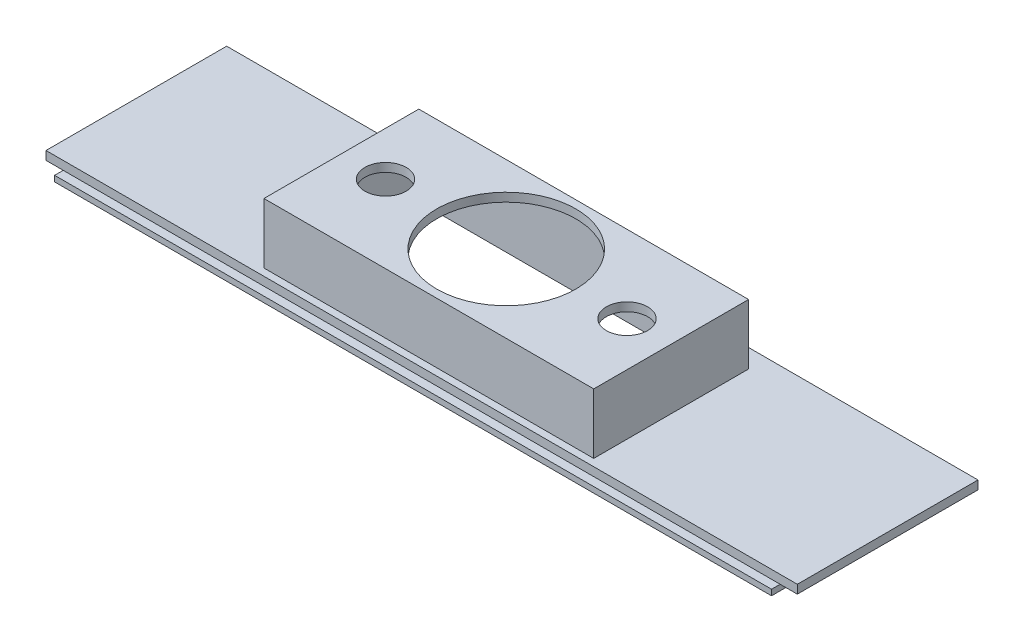
ISO-10303-21;
HEADER;
FILE_DESCRIPTION(('STEP AP214'),'2;1');
FILE_NAME('part.step','',(''),(''),'','','');
FILE_SCHEMA(('AUTOMOTIVE_DESIGN { 1 0 10303 214 1 1 1 1 }'));
ENDSEC;
DATA;
#1=APPLICATION_CONTEXT('core data for automotive mechanical design processes');
#2=APPLICATION_PROTOCOL_DEFINITION('international standard','automotive_design',2000,#1);
#3=PRODUCT_CONTEXT('',#1,'mechanical');
#4=PRODUCT('Part','Part','',(#3));
#5=PRODUCT_RELATED_PRODUCT_CATEGORY('part','',(#4));
#6=PRODUCT_DEFINITION_FORMATION('','',#4);
#7=PRODUCT_DEFINITION_CONTEXT('part definition',#1,'design');
#8=PRODUCT_DEFINITION('design','',#6,#7);
#9=PRODUCT_DEFINITION_SHAPE('','',#8);
#10=(LENGTH_UNIT() NAMED_UNIT(*) SI_UNIT(.MILLI.,.METRE.));
#11=(NAMED_UNIT(*) PLANE_ANGLE_UNIT() SI_UNIT($,.RADIAN.));
#12=(NAMED_UNIT(*) SI_UNIT($,.STERADIAN.) SOLID_ANGLE_UNIT());
#13=UNCERTAINTY_MEASURE_WITH_UNIT(LENGTH_MEASURE(1.E-05),#10,'distance_accuracy_value','');
#14=(GEOMETRIC_REPRESENTATION_CONTEXT(3) GLOBAL_UNCERTAINTY_ASSIGNED_CONTEXT((#13)) GLOBAL_UNIT_ASSIGNED_CONTEXT((#10,
#11,#12)) REPRESENTATION_CONTEXT('',''));
#15=CARTESIAN_POINT('',(0.,0.,0.));
#16=DIRECTION('',(0.,0.,1.));
#17=DIRECTION('',(1.,0.,0.));
#18=AXIS2_PLACEMENT_3D('',#15,#16,#17);
#19=CARTESIAN_POINT('',(0.,0.,0.));
#20=DIRECTION('',(0.,1.,0.));
#21=DIRECTION('',(0.,0.,1.));
#22=AXIS2_PLACEMENT_3D('',#19,#20,#21);
#23=PLANE('',#22);
#24=DIRECTION('',(0.,0.,-1.));
#25=VECTOR('',#24,1.);
#26=CARTESIAN_POINT('',(-125.,0.,31.5));
#27=LINE('',#26,#25);
#28=CARTESIAN_POINT('',(-125.,0.,29.5));
#29=VERTEX_POINT('',#28);
#30=CARTESIAN_POINT('',(-125.,0.,-27.5));
#31=VERTEX_POINT('',#30);
#32=EDGE_CURVE('E11',#29,#31,#27,.T.);
#33=ORIENTED_EDGE('',*,*,#32,.F.);
#34=DIRECTION('',(1.,0.,0.));
#35=VECTOR('',#34,1.);
#36=CARTESIAN_POINT('',(-127.,0.,29.5));
#37=LINE('',#36,#35);
#38=CARTESIAN_POINT('',(-131.,0.,29.5));
#39=VERTEX_POINT('',#38);
#40=EDGE_CURVE('E38',#39,#29,#37,.T.);
#41=ORIENTED_EDGE('',*,*,#40,.F.);
#42=DIRECTION('',(0.,0.,1.));
#43=VECTOR('',#42,1.);
#44=CARTESIAN_POINT('',(-131.,0.,-29.5));
#45=LINE('',#44,#43);
#46=CARTESIAN_POINT('',(-131.,0.,-33.5));
#47=VERTEX_POINT('',#46);
#48=EDGE_CURVE('E206',#47,#39,#45,.T.);
#49=ORIENTED_EDGE('',*,*,#48,.F.);
#50=DIRECTION('',(-1.,0.,0.));
#51=VECTOR('',#50,1.);
#52=CARTESIAN_POINT('',(127.,0.,-33.5));
#53=LINE('',#52,#51);
#54=CARTESIAN_POINT('',(131.,0.,-33.5));
#55=VERTEX_POINT('',#54);
#56=EDGE_CURVE('E198',#55,#47,#53,.T.);
#57=ORIENTED_EDGE('',*,*,#56,.F.);
#58=DIRECTION('',(0.,0.,-1.));
#59=VECTOR('',#58,1.);
#60=CARTESIAN_POINT('',(131.,0.,29.5));
#61=LINE('',#60,#59);
#62=CARTESIAN_POINT('',(131.,0.,29.5));
#63=VERTEX_POINT('',#62);
#64=EDGE_CURVE('E189',#63,#55,#61,.T.);
#65=ORIENTED_EDGE('',*,*,#64,.F.);
#66=CARTESIAN_POINT('',(125.,0.,29.5));
#67=VERTEX_POINT('',#66);
#68=EDGE_CURVE('E57',#67,#63,#37,.T.);
#69=ORIENTED_EDGE('',*,*,#68,.F.);
#70=DIRECTION('',(0.,0.,1.));
#71=VECTOR('',#70,1.);
#72=CARTESIAN_POINT('',(125.,0.,-27.5));
#73=LINE('',#72,#71);
#74=CARTESIAN_POINT('',(125.,0.,-27.5));
#75=VERTEX_POINT('',#74);
#76=EDGE_CURVE('E165',#75,#67,#73,.T.);
#77=ORIENTED_EDGE('',*,*,#76,.F.);
#78=DIRECTION('',(1.,0.,0.));
#79=VECTOR('',#78,1.);
#80=CARTESIAN_POINT('',(-125.,0.,-27.5));
#81=LINE('',#80,#79);
#82=EDGE_CURVE('E52',#31,#75,#81,.T.);
#83=ORIENTED_EDGE('',*,*,#82,.F.);
#84=EDGE_LOOP('',(#33,#41,#49,#57,#65,#69,#77,#83));
#85=FACE_BOUND('',#84,.T.);
#86=ADVANCED_FACE('F34',(#85),#23,.F.);
#87=CARTESIAN_POINT('',(0.,3.,0.));
#88=DIRECTION('',(0.,1.,0.));
#89=DIRECTION('',(0.,0.,1.));
#90=AXIS2_PLACEMENT_3D('',#87,#88,#89);
#91=PLANE('',#90);
#92=DIRECTION('',(1.,0.,0.));
#93=VECTOR('',#92,1.);
#94=CARTESIAN_POINT('',(-127.,3.,29.5));
#95=LINE('',#94,#93);
#96=CARTESIAN_POINT('',(-131.,3.,29.5));
#97=VERTEX_POINT('',#96);
#98=CARTESIAN_POINT('',(131.,3.,29.5));
#99=VERTEX_POINT('',#98);
#100=EDGE_CURVE('E43',#97,#99,#95,.T.);
#101=ORIENTED_EDGE('',*,*,#100,.T.);
#102=DIRECTION('',(0.,0.,1.));
#103=VECTOR('',#102,1.);
#104=CARTESIAN_POINT('',(131.,3.,29.5));
#105=LINE('',#104,#103);
#106=CARTESIAN_POINT('',(131.,3.,-33.5));
#107=VERTEX_POINT('',#106);
#108=EDGE_CURVE('E195',#107,#99,#105,.T.);
#109=ORIENTED_EDGE('',*,*,#108,.F.);
#110=DIRECTION('',(1.,0.,0.));
#111=VECTOR('',#110,1.);
#112=CARTESIAN_POINT('',(127.,3.,-33.5));
#113=LINE('',#112,#111);
#114=CARTESIAN_POINT('',(-131.,3.,-33.5));
#115=VERTEX_POINT('',#114);
#116=EDGE_CURVE('E204',#115,#107,#113,.T.);
#117=ORIENTED_EDGE('',*,*,#116,.F.);
#118=DIRECTION('',(0.,0.,-1.));
#119=VECTOR('',#118,1.);
#120=CARTESIAN_POINT('',(-131.,3.,-29.5));
#121=LINE('',#120,#119);
#122=EDGE_CURVE('E212',#97,#115,#121,.T.);
#123=ORIENTED_EDGE('',*,*,#122,.F.);
#124=EDGE_LOOP('',(#101,#109,#117,#123));
#125=FACE_BOUND('',#124,.T.);
#126=DIRECTION('',(-1.,0.,0.));
#127=VECTOR('',#126,1.);
#128=CARTESIAN_POINT('',(-57.5,3.,-27.));
#129=LINE('',#128,#127);
#130=CARTESIAN_POINT('',(57.5,3.,-27.));
#131=VERTEX_POINT('',#130);
#132=CARTESIAN_POINT('',(-57.5,3.,-27.));
#133=VERTEX_POINT('',#132);
#134=EDGE_CURVE('E286',#131,#133,#129,.T.);
#135=ORIENTED_EDGE('',*,*,#134,.F.);
#136=DIRECTION('',(0.,0.,-1.));
#137=VECTOR('',#136,1.);
#138=CARTESIAN_POINT('',(57.5,3.,-27.));
#139=LINE('',#138,#137);
#140=CARTESIAN_POINT('',(57.5,3.,27.));
#141=VERTEX_POINT('',#140);
#142=EDGE_CURVE('E267',#141,#131,#139,.T.);
#143=ORIENTED_EDGE('',*,*,#142,.F.);
#144=DIRECTION('',(1.,0.,0.));
#145=VECTOR('',#144,1.);
#146=CARTESIAN_POINT('',(-57.5,3.,27.));
#147=LINE('',#146,#145);
#148=CARTESIAN_POINT('',(-57.5,3.,27.));
#149=VERTEX_POINT('',#148);
#150=EDGE_CURVE('E277',#149,#141,#147,.T.);
#151=ORIENTED_EDGE('',*,*,#150,.F.);
#152=DIRECTION('',(0.,0.,1.));
#153=VECTOR('',#152,1.);
#154=CARTESIAN_POINT('',(-57.5,3.,-27.));
#155=LINE('',#154,#153);
#156=EDGE_CURVE('E288',#133,#149,#155,.T.);
#157=ORIENTED_EDGE('',*,*,#156,.F.);
#158=EDGE_LOOP('',(#135,#143,#151,#157));
#159=FACE_BOUND('',#158,.T.);
#160=ADVANCED_FACE('F314',(#125,#159),#91,.T.);
#161=CARTESIAN_POINT('',(-127.,3.,29.5));
#162=DIRECTION('',(0.,0.,-1.));
#163=DIRECTION('',(-1.,0.,0.));
#164=AXIS2_PLACEMENT_3D('',#161,#162,#163);
#165=PLANE('',#164);
#166=ORIENTED_EDGE('',*,*,#40,.T.);
#167=EDGE_CURVE('E304',#29,#67,#37,.T.);
#168=ORIENTED_EDGE('',*,*,#167,.T.);
#169=ORIENTED_EDGE('',*,*,#68,.T.);
#170=DIRECTION('',(0.,-1.,0.));
#171=VECTOR('',#170,1.);
#172=CARTESIAN_POINT('',(131.,3.,29.5));
#173=LINE('',#172,#171);
#174=EDGE_CURVE('E186',#99,#63,#173,.T.);
#175=ORIENTED_EDGE('',*,*,#174,.F.);
#176=ORIENTED_EDGE('',*,*,#100,.F.);
#177=DIRECTION('',(0.,1.,0.));
#178=VECTOR('',#177,1.);
#179=CARTESIAN_POINT('',(-131.,3.,29.5));
#180=LINE('',#179,#178);
#181=EDGE_CURVE('E209',#39,#97,#180,.T.);
#182=ORIENTED_EDGE('',*,*,#181,.F.);
#183=EDGE_LOOP('',(#166,#168,#169,#175,#176,#182));
#184=FACE_BOUND('',#183,.T.);
#185=ADVANCED_FACE('F36',(#184),#165,.F.);
#186=CARTESIAN_POINT('',(57.5,24.,-27.));
#187=DIRECTION('',(-1.,0.,0.));
#188=DIRECTION('',(0.,0.,1.));
#189=AXIS2_PLACEMENT_3D('',#186,#187,#188);
#190=PLANE('',#189);
#191=ORIENTED_EDGE('',*,*,#142,.T.);
#192=DIRECTION('',(0.,-1.,0.));
#193=VECTOR('',#192,1.);
#194=CARTESIAN_POINT('',(57.5,24.,-27.));
#195=LINE('',#194,#193);
#196=CARTESIAN_POINT('',(57.5,24.,-27.));
#197=VERTEX_POINT('',#196);
#198=EDGE_CURVE('E299',#197,#131,#195,.T.);
#199=ORIENTED_EDGE('',*,*,#198,.F.);
#200=DIRECTION('',(0.,0.,-1.));
#201=VECTOR('',#200,1.);
#202=CARTESIAN_POINT('',(57.5,24.,-27.));
#203=LINE('',#202,#201);
#204=CARTESIAN_POINT('',(57.5,24.,27.));
#205=VERTEX_POINT('',#204);
#206=EDGE_CURVE('E273',#205,#197,#203,.T.);
#207=ORIENTED_EDGE('',*,*,#206,.F.);
#208=DIRECTION('',(0.,-1.,0.));
#209=VECTOR('',#208,1.);
#210=CARTESIAN_POINT('',(57.5,24.,27.));
#211=LINE('',#210,#209);
#212=EDGE_CURVE('E283',#205,#141,#211,.T.);
#213=ORIENTED_EDGE('',*,*,#212,.T.);
#214=EDGE_LOOP('',(#191,#199,#207,#213));
#215=FACE_BOUND('',#214,.T.);
#216=ADVANCED_FACE('F344',(#215),#190,.F.);
#217=CARTESIAN_POINT('',(-57.5,24.,-27.));
#218=DIRECTION('',(0.,0.,1.));
#219=DIRECTION('',(1.,0.,0.));
#220=AXIS2_PLACEMENT_3D('',#217,#218,#219);
#221=PLANE('',#220);
#222=ORIENTED_EDGE('',*,*,#134,.T.);
#223=DIRECTION('',(0.,-1.,0.));
#224=VECTOR('',#223,1.);
#225=CARTESIAN_POINT('',(-57.5,24.,-27.));
#226=LINE('',#225,#224);
#227=CARTESIAN_POINT('',(-57.5,24.,-27.));
#228=VERTEX_POINT('',#227);
#229=EDGE_CURVE('E296',#228,#133,#226,.T.);
#230=ORIENTED_EDGE('',*,*,#229,.F.);
#231=DIRECTION('',(-1.,0.,0.));
#232=VECTOR('',#231,1.);
#233=CARTESIAN_POINT('',(-57.5,24.,-27.));
#234=LINE('',#233,#232);
#235=EDGE_CURVE('E276',#197,#228,#234,.T.);
#236=ORIENTED_EDGE('',*,*,#235,.F.);
#237=ORIENTED_EDGE('',*,*,#198,.T.);
#238=EDGE_LOOP('',(#222,#230,#236,#237));
#239=FACE_BOUND('',#238,.T.);
#240=ADVANCED_FACE('F347',(#239),#221,.F.);
#241=CARTESIAN_POINT('',(-57.5,24.,-27.));
#242=DIRECTION('',(1.,0.,0.));
#243=DIRECTION('',(0.,0.,-1.));
#244=AXIS2_PLACEMENT_3D('',#241,#242,#243);
#245=PLANE('',#244);
#246=ORIENTED_EDGE('',*,*,#156,.T.);
#247=DIRECTION('',(0.,-1.,0.));
#248=VECTOR('',#247,1.);
#249=CARTESIAN_POINT('',(-57.5,24.,27.));
#250=LINE('',#249,#248);
#251=CARTESIAN_POINT('',(-57.5,24.,27.));
#252=VERTEX_POINT('',#251);
#253=EDGE_CURVE('E294',#252,#149,#250,.T.);
#254=ORIENTED_EDGE('',*,*,#253,.F.);
#255=DIRECTION('',(0.,0.,1.));
#256=VECTOR('',#255,1.);
#257=CARTESIAN_POINT('',(-57.5,24.,-27.));
#258=LINE('',#257,#256);
#259=EDGE_CURVE('E279',#228,#252,#258,.T.);
#260=ORIENTED_EDGE('',*,*,#259,.F.);
#261=ORIENTED_EDGE('',*,*,#229,.T.);
#262=EDGE_LOOP('',(#246,#254,#260,#261));
#263=FACE_BOUND('',#262,.T.);
#264=ADVANCED_FACE('F351',(#263),#245,.F.);
#265=CARTESIAN_POINT('',(-57.5,24.,27.));
#266=DIRECTION('',(0.,0.,-1.));
#267=DIRECTION('',(-1.,0.,0.));
#268=AXIS2_PLACEMENT_3D('',#265,#266,#267);
#269=PLANE('',#268);
#270=ORIENTED_EDGE('',*,*,#150,.T.);
#271=ORIENTED_EDGE('',*,*,#212,.F.);
#272=DIRECTION('',(1.,0.,0.));
#273=VECTOR('',#272,1.);
#274=CARTESIAN_POINT('',(-57.5,24.,27.));
#275=LINE('',#274,#273);
#276=EDGE_CURVE('E281',#252,#205,#275,.T.);
#277=ORIENTED_EDGE('',*,*,#276,.F.);
#278=ORIENTED_EDGE('',*,*,#253,.T.);
#279=EDGE_LOOP('',(#270,#271,#277,#278));
#280=FACE_BOUND('',#279,.T.);
#281=ADVANCED_FACE('F355',(#280),#269,.F.);
#282=CARTESIAN_POINT('',(0.,24.,0.));
#283=DIRECTION('',(0.,1.,0.));
#284=DIRECTION('',(0.,0.,1.));
#285=AXIS2_PLACEMENT_3D('',#282,#283,#284);
#286=PLANE('',#285);
#287=CARTESIAN_POINT('',(0.,24.,0.));
#288=DIRECTION('',(0.,1.,0.));
#289=DIRECTION('',(0.,0.,1.));
#290=AXIS2_PLACEMENT_3D('',#287,#288,#289);
#291=CIRCLE('',#290,24.25);
#292=CARTESIAN_POINT('',(0.,24.,24.25));
#293=VERTEX_POINT('',#292);
#294=EDGE_CURVE('E241',#293,#293,#291,.T.);
#295=ORIENTED_EDGE('',*,*,#294,.F.);
#296=EDGE_LOOP('',(#295));
#297=FACE_BOUND('',#296,.T.);
#298=CARTESIAN_POINT('',(42.1,24.,0.));
#299=DIRECTION('',(0.,1.,0.));
#300=DIRECTION('',(0.,0.,1.));
#301=AXIS2_PLACEMENT_3D('',#298,#299,#300);
#302=CIRCLE('',#301,7.2);
#303=CARTESIAN_POINT('',(42.1,24.,7.19999999999999));
#304=VERTEX_POINT('',#303);
#305=EDGE_CURVE('E236',#304,#304,#302,.T.);
#306=ORIENTED_EDGE('',*,*,#305,.F.);
#307=EDGE_LOOP('',(#306));
#308=FACE_BOUND('',#307,.T.);
#309=CARTESIAN_POINT('',(-42.1,24.,0.));
#310=DIRECTION('',(0.,1.,0.));
#311=DIRECTION('',(0.,0.,1.));
#312=AXIS2_PLACEMENT_3D('',#309,#310,#311);
#313=CIRCLE('',#312,7.2);
#314=CARTESIAN_POINT('',(-42.1,24.,7.19999999999999));
#315=VERTEX_POINT('',#314);
#316=EDGE_CURVE('E240',#315,#315,#313,.T.);
#317=ORIENTED_EDGE('',*,*,#316,.F.);
#318=EDGE_LOOP('',(#317));
#319=FACE_BOUND('',#318,.T.);
#320=ORIENTED_EDGE('',*,*,#206,.T.);
#321=ORIENTED_EDGE('',*,*,#235,.T.);
#322=ORIENTED_EDGE('',*,*,#259,.T.);
#323=ORIENTED_EDGE('',*,*,#276,.T.);
#324=EDGE_LOOP('',(#320,#321,#322,#323));
#325=FACE_BOUND('',#324,.T.);
#326=ADVANCED_FACE('F359',(#297,#308,#319,#325),#286,.T.);
#327=CARTESIAN_POINT('',(-55.5,21.,0.));
#328=DIRECTION('',(1.,0.,0.));
#329=DIRECTION('',(0.,0.,-1.));
#330=AXIS2_PLACEMENT_3D('',#327,#328,#329);
#331=PLANE('',#330);
#332=DIRECTION('',(0.,-1.,0.));
#333=VECTOR('',#332,1.);
#334=CARTESIAN_POINT('',(-55.5,21.,25.));
#335=LINE('',#334,#333);
#336=CARTESIAN_POINT('',(-55.5,21.,25.));
#337=VERTEX_POINT('',#336);
#338=CARTESIAN_POINT('',(-55.5,-2.,25.));
#339=VERTEX_POINT('',#338);
#340=EDGE_CURVE('E265',#337,#339,#335,.T.);
#341=ORIENTED_EDGE('',*,*,#340,.T.);
#342=DIRECTION('',(0.,0.,-1.));
#343=VECTOR('',#342,1.);
#344=CARTESIAN_POINT('',(-55.5,-2.,-25.));
#345=LINE('',#344,#343);
#346=CARTESIAN_POINT('',(-55.5,-2.,-25.));
#347=VERTEX_POINT('',#346);
#348=EDGE_CURVE('E223',#339,#347,#345,.T.);
#349=ORIENTED_EDGE('',*,*,#348,.T.);
#350=DIRECTION('',(0.,-1.,0.));
#351=VECTOR('',#350,1.);
#352=CARTESIAN_POINT('',(-55.5,21.,-25.));
#353=LINE('',#352,#351);
#354=CARTESIAN_POINT('',(-55.5,21.,-25.));
#355=VERTEX_POINT('',#354);
#356=EDGE_CURVE('E264',#355,#347,#353,.T.);
#357=ORIENTED_EDGE('',*,*,#356,.F.);
#358=DIRECTION('',(0.,0.,1.));
#359=VECTOR('',#358,1.);
#360=CARTESIAN_POINT('',(-55.5,21.,0.));
#361=LINE('',#360,#359);
#362=EDGE_CURVE('E252',#355,#337,#361,.T.);
#363=ORIENTED_EDGE('',*,*,#362,.T.);
#364=EDGE_LOOP('',(#341,#349,#357,#363));
#365=FACE_BOUND('',#364,.T.);
#366=ADVANCED_FACE('F363',(#365),#331,.T.);
#367=CARTESIAN_POINT('',(0.,21.,25.));
#368=DIRECTION('',(0.,0.,-1.));
#369=DIRECTION('',(-1.,0.,0.));
#370=AXIS2_PLACEMENT_3D('',#367,#368,#369);
#371=PLANE('',#370);
#372=DIRECTION('',(0.,-1.,0.));
#373=VECTOR('',#372,1.);
#374=CARTESIAN_POINT('',(55.5,21.,25.));
#375=LINE('',#374,#373);
#376=CARTESIAN_POINT('',(55.5,21.,25.));
#377=VERTEX_POINT('',#376);
#378=CARTESIAN_POINT('',(55.5,-2.,25.));
#379=VERTEX_POINT('',#378);
#380=EDGE_CURVE('E268',#377,#379,#375,.T.);
#381=ORIENTED_EDGE('',*,*,#380,.T.);
#382=DIRECTION('',(-1.,0.,0.));
#383=VECTOR('',#382,1.);
#384=CARTESIAN_POINT('',(-55.5,-2.,25.));
#385=LINE('',#384,#383);
#386=EDGE_CURVE('E220',#379,#339,#385,.T.);
#387=ORIENTED_EDGE('',*,*,#386,.T.);
#388=ORIENTED_EDGE('',*,*,#340,.F.);
#389=DIRECTION('',(1.,0.,0.));
#390=VECTOR('',#389,1.);
#391=CARTESIAN_POINT('',(0.,21.,25.));
#392=LINE('',#391,#390);
#393=EDGE_CURVE('E262',#337,#377,#392,.T.);
#394=ORIENTED_EDGE('',*,*,#393,.T.);
#395=EDGE_LOOP('',(#381,#387,#388,#394));
#396=FACE_BOUND('',#395,.T.);
#397=ADVANCED_FACE('F367',(#396),#371,.T.);
#398=CARTESIAN_POINT('',(55.5,21.,0.));
#399=DIRECTION('',(-1.,0.,0.));
#400=DIRECTION('',(0.,0.,1.));
#401=AXIS2_PLACEMENT_3D('',#398,#399,#400);
#402=PLANE('',#401);
#403=DIRECTION('',(0.,-1.,0.));
#404=VECTOR('',#403,1.);
#405=CARTESIAN_POINT('',(55.5,21.,-25.));
#406=LINE('',#405,#404);
#407=CARTESIAN_POINT('',(55.5,21.,-25.));
#408=VERTEX_POINT('',#407);
#409=CARTESIAN_POINT('',(55.5,-2.,-25.));
#410=VERTEX_POINT('',#409);
#411=EDGE_CURVE('E270',#408,#410,#406,.T.);
#412=ORIENTED_EDGE('',*,*,#411,.T.);
#413=DIRECTION('',(0.,0.,1.));
#414=VECTOR('',#413,1.);
#415=CARTESIAN_POINT('',(55.5,-2.,25.));
#416=LINE('',#415,#414);
#417=EDGE_CURVE('E217',#410,#379,#416,.T.);
#418=ORIENTED_EDGE('',*,*,#417,.T.);
#419=ORIENTED_EDGE('',*,*,#380,.F.);
#420=DIRECTION('',(0.,0.,-1.));
#421=VECTOR('',#420,1.);
#422=CARTESIAN_POINT('',(55.5,21.,0.));
#423=LINE('',#422,#421);
#424=EDGE_CURVE('E260',#377,#408,#423,.T.);
#425=ORIENTED_EDGE('',*,*,#424,.T.);
#426=EDGE_LOOP('',(#412,#418,#419,#425));
#427=FACE_BOUND('',#426,.T.);
#428=ADVANCED_FACE('F373',(#427),#402,.T.);
#429=CARTESIAN_POINT('',(0.,21.,-25.));
#430=DIRECTION('',(0.,0.,-1.));
#431=DIRECTION('',(-1.,0.,0.));
#432=AXIS2_PLACEMENT_3D('',#429,#430,#431);
#433=PLANE('',#432);
#434=ORIENTED_EDGE('',*,*,#356,.T.);
#435=DIRECTION('',(1.,0.,0.));
#436=VECTOR('',#435,1.);
#437=CARTESIAN_POINT('',(-55.5,-2.,-25.));
#438=LINE('',#437,#436);
#439=EDGE_CURVE('E214',#347,#410,#438,.T.);
#440=ORIENTED_EDGE('',*,*,#439,.T.);
#441=ORIENTED_EDGE('',*,*,#411,.F.);
#442=DIRECTION('',(1.,0.,0.));
#443=VECTOR('',#442,1.);
#444=CARTESIAN_POINT('',(0.,21.,-25.));
#445=LINE('',#444,#443);
#446=EDGE_CURVE('E257',#355,#408,#445,.T.);
#447=ORIENTED_EDGE('',*,*,#446,.F.);
#448=EDGE_LOOP('',(#434,#440,#441,#447));
#449=FACE_BOUND('',#448,.T.);
#450=ADVANCED_FACE('F369',(#449),#433,.F.);
#451=CARTESIAN_POINT('',(0.,21.,0.));
#452=DIRECTION('',(0.,-1.,0.));
#453=DIRECTION('',(0.,0.,-1.));
#454=AXIS2_PLACEMENT_3D('',#451,#452,#453);
#455=PLANE('',#454);
#456=CARTESIAN_POINT('',(0.,21.,0.));
#457=DIRECTION('',(0.,1.,0.));
#458=DIRECTION('',(0.,0.,1.));
#459=AXIS2_PLACEMENT_3D('',#456,#457,#458);
#460=CIRCLE('',#459,24.25);
#461=CARTESIAN_POINT('',(0.,21.,24.25));
#462=VERTEX_POINT('',#461);
#463=EDGE_CURVE('E237',#462,#462,#460,.T.);
#464=ORIENTED_EDGE('',*,*,#463,.T.);
#465=EDGE_LOOP('',(#464));
#466=FACE_BOUND('',#465,.T.);
#467=CARTESIAN_POINT('',(42.1,21.,0.));
#468=DIRECTION('',(0.,1.,0.));
#469=DIRECTION('',(0.,0.,1.));
#470=AXIS2_PLACEMENT_3D('',#467,#468,#469);
#471=CIRCLE('',#470,7.2);
#472=CARTESIAN_POINT('',(42.1,21.,7.19999999999999));
#473=VERTEX_POINT('',#472);
#474=EDGE_CURVE('E244',#473,#473,#471,.T.);
#475=ORIENTED_EDGE('',*,*,#474,.T.);
#476=EDGE_LOOP('',(#475));
#477=FACE_BOUND('',#476,.T.);
#478=CARTESIAN_POINT('',(-42.1,21.,0.));
#479=DIRECTION('',(0.,1.,0.));
#480=DIRECTION('',(0.,0.,1.));
#481=AXIS2_PLACEMENT_3D('',#478,#479,#480);
#482=CIRCLE('',#481,7.2);
#483=CARTESIAN_POINT('',(-42.1,21.,7.19999999999999));
#484=VERTEX_POINT('',#483);
#485=EDGE_CURVE('E249',#484,#484,#482,.T.);
#486=ORIENTED_EDGE('',*,*,#485,.T.);
#487=EDGE_LOOP('',(#486));
#488=FACE_BOUND('',#487,.T.);
#489=ORIENTED_EDGE('',*,*,#362,.F.);
#490=ORIENTED_EDGE('',*,*,#446,.T.);
#491=ORIENTED_EDGE('',*,*,#424,.F.);
#492=ORIENTED_EDGE('',*,*,#393,.F.);
#493=EDGE_LOOP('',(#489,#490,#491,#492));
#494=FACE_BOUND('',#493,.T.);
#495=ADVANCED_FACE('F372',(#466,#477,#488,#494),#455,.T.);
#496=CARTESIAN_POINT('',(-42.1,21.,0.));
#497=DIRECTION('',(0.,1.,0.));
#498=DIRECTION('',(0.,0.,1.));
#499=AXIS2_PLACEMENT_3D('',#496,#497,#498);
#500=CYLINDRICAL_SURFACE('',#499,7.2);
#501=ORIENTED_EDGE('',*,*,#485,.F.);
#502=EDGE_LOOP('',(#501));
#503=FACE_BOUND('',#502,.T.);
#504=ORIENTED_EDGE('',*,*,#316,.T.);
#505=EDGE_LOOP('',(#504));
#506=FACE_BOUND('',#505,.T.);
#507=ADVANCED_FACE('F383',(#503,#506),#500,.F.);
#508=CARTESIAN_POINT('',(42.1,21.,0.));
#509=DIRECTION('',(0.,1.,0.));
#510=DIRECTION('',(0.,0.,1.));
#511=AXIS2_PLACEMENT_3D('',#508,#509,#510);
#512=CYLINDRICAL_SURFACE('',#511,7.2);
#513=ORIENTED_EDGE('',*,*,#474,.F.);
#514=EDGE_LOOP('',(#513));
#515=FACE_BOUND('',#514,.T.);
#516=ORIENTED_EDGE('',*,*,#305,.T.);
#517=EDGE_LOOP('',(#516));
#518=FACE_BOUND('',#517,.T.);
#519=ADVANCED_FACE('F387',(#515,#518),#512,.F.);
#520=CARTESIAN_POINT('',(0.,21.,0.));
#521=DIRECTION('',(0.,1.,0.));
#522=DIRECTION('',(0.,0.,1.));
#523=AXIS2_PLACEMENT_3D('',#520,#521,#522);
#524=CYLINDRICAL_SURFACE('',#523,24.25);
#525=ORIENTED_EDGE('',*,*,#463,.F.);
#526=EDGE_LOOP('',(#525));
#527=FACE_BOUND('',#526,.T.);
#528=ORIENTED_EDGE('',*,*,#294,.T.);
#529=EDGE_LOOP('',(#528));
#530=FACE_BOUND('',#529,.T.);
#531=ADVANCED_FACE('F335',(#527,#530),#524,.F.);
#532=CARTESIAN_POINT('',(0.,-2.,0.));
#533=DIRECTION('',(0.,-1.,0.));
#534=DIRECTION('',(0.,0.,-1.));
#535=AXIS2_PLACEMENT_3D('',#532,#533,#534);
#536=PLANE('',#535);
#537=DIRECTION('',(0.,0.,-1.));
#538=VECTOR('',#537,1.);
#539=CARTESIAN_POINT('',(-125.,-2.,31.5));
#540=LINE('',#539,#538);
#541=CARTESIAN_POINT('',(-125.,-2.,32.5));
#542=VERTEX_POINT('',#541);
#543=CARTESIAN_POINT('',(-125.,-2.,-27.5));
#544=VERTEX_POINT('',#543);
#545=EDGE_CURVE('E155',#542,#544,#540,.T.);
#546=ORIENTED_EDGE('',*,*,#545,.T.);
#547=DIRECTION('',(1.,0.,0.));
#548=VECTOR('',#547,1.);
#549=CARTESIAN_POINT('',(-125.,-2.,-27.5));
#550=LINE('',#549,#548);
#551=CARTESIAN_POINT('',(125.,-2.,-27.5));
#552=VERTEX_POINT('',#551);
#553=EDGE_CURVE('E164',#544,#552,#550,.T.);
#554=ORIENTED_EDGE('',*,*,#553,.T.);
#555=DIRECTION('',(0.,0.,1.));
#556=VECTOR('',#555,1.);
#557=CARTESIAN_POINT('',(125.,-2.,-27.5));
#558=LINE('',#557,#556);
#559=CARTESIAN_POINT('',(125.,-2.,32.5));
#560=VERTEX_POINT('',#559);
#561=EDGE_CURVE('E172',#552,#560,#558,.T.);
#562=ORIENTED_EDGE('',*,*,#561,.T.);
#563=DIRECTION('',(1.,0.,0.));
#564=VECTOR('',#563,1.);
#565=CARTESIAN_POINT('',(-125.,-2.,32.5));
#566=LINE('',#565,#564);
#567=EDGE_CURVE('E168',#542,#560,#566,.T.);
#568=ORIENTED_EDGE('',*,*,#567,.F.);
#569=EDGE_LOOP('',(#546,#554,#562,#568));
#570=FACE_BOUND('',#569,.T.);
#571=ORIENTED_EDGE('',*,*,#417,.F.);
#572=ORIENTED_EDGE('',*,*,#439,.F.);
#573=ORIENTED_EDGE('',*,*,#348,.F.);
#574=ORIENTED_EDGE('',*,*,#386,.F.);
#575=EDGE_LOOP('',(#571,#572,#573,#574));
#576=FACE_BOUND('',#575,.T.);
#577=ADVANCED_FACE('F169',(#570,#576),#536,.T.);
#578=CARTESIAN_POINT('',(0.,0.,0.));
#579=DIRECTION('',(0.,-1.,0.));
#580=DIRECTION('',(0.,0.,-1.));
#581=AXIS2_PLACEMENT_3D('',#578,#579,#580);
#582=PLANE('',#581);
#583=ORIENTED_EDGE('',*,*,#167,.F.);
#584=CARTESIAN_POINT('',(-125.,0.,32.5));
#585=VERTEX_POINT('',#584);
#586=EDGE_CURVE('E45',#585,#29,#27,.T.);
#587=ORIENTED_EDGE('',*,*,#586,.F.);
#588=DIRECTION('',(-1.,0.,0.));
#589=VECTOR('',#588,1.);
#590=CARTESIAN_POINT('',(-125.,0.,32.5));
#591=LINE('',#590,#589);
#592=CARTESIAN_POINT('',(125.,0.,32.5));
#593=VERTEX_POINT('',#592);
#594=EDGE_CURVE('E181',#593,#585,#591,.T.);
#595=ORIENTED_EDGE('',*,*,#594,.F.);
#596=EDGE_CURVE('E230',#67,#593,#73,.T.);
#597=ORIENTED_EDGE('',*,*,#596,.F.);
#598=EDGE_LOOP('',(#583,#587,#595,#597));
#599=FACE_BOUND('',#598,.T.);
#600=ADVANCED_FACE('F327',(#599),#582,.F.);
#601=CARTESIAN_POINT('',(-125.,-2.,31.5));
#602=DIRECTION('',(1.,0.,0.));
#603=DIRECTION('',(0.,0.,-1.));
#604=AXIS2_PLACEMENT_3D('',#601,#602,#603);
#605=PLANE('',#604);
#606=ORIENTED_EDGE('',*,*,#586,.T.);
#607=ORIENTED_EDGE('',*,*,#32,.T.);
#608=DIRECTION('',(0.,1.,0.));
#609=VECTOR('',#608,1.);
#610=CARTESIAN_POINT('',(-125.,-2.,-27.5));
#611=LINE('',#610,#609);
#612=EDGE_CURVE('E162',#544,#31,#611,.T.);
#613=ORIENTED_EDGE('',*,*,#612,.F.);
#614=ORIENTED_EDGE('',*,*,#545,.F.);
#615=DIRECTION('',(0.,-1.,0.));
#616=VECTOR('',#615,1.);
#617=CARTESIAN_POINT('',(-125.,-2.,32.5));
#618=LINE('',#617,#616);
#619=EDGE_CURVE('E160',#585,#542,#618,.T.);
#620=ORIENTED_EDGE('',*,*,#619,.F.);
#621=EDGE_LOOP('',(#606,#607,#613,#614,#620));
#622=FACE_BOUND('',#621,.T.);
#623=ADVANCED_FACE('F158',(#622),#605,.F.);
#624=CARTESIAN_POINT('',(-125.,-2.,-27.5));
#625=DIRECTION('',(0.,0.,1.));
#626=DIRECTION('',(1.,0.,0.));
#627=AXIS2_PLACEMENT_3D('',#624,#625,#626);
#628=PLANE('',#627);
#629=ORIENTED_EDGE('',*,*,#82,.T.);
#630=DIRECTION('',(0.,1.,0.));
#631=VECTOR('',#630,1.);
#632=CARTESIAN_POINT('',(125.,-2.,-27.5));
#633=LINE('',#632,#631);
#634=EDGE_CURVE('E227',#552,#75,#633,.T.);
#635=ORIENTED_EDGE('',*,*,#634,.F.);
#636=ORIENTED_EDGE('',*,*,#553,.F.);
#637=ORIENTED_EDGE('',*,*,#612,.T.);
#638=EDGE_LOOP('',(#629,#635,#636,#637));
#639=FACE_BOUND('',#638,.T.);
#640=ADVANCED_FACE('F322',(#639),#628,.F.);
#641=CARTESIAN_POINT('',(125.,-2.,-27.5));
#642=DIRECTION('',(-1.,0.,0.));
#643=DIRECTION('',(0.,0.,1.));
#644=AXIS2_PLACEMENT_3D('',#641,#642,#643);
#645=PLANE('',#644);
#646=ORIENTED_EDGE('',*,*,#76,.T.);
#647=ORIENTED_EDGE('',*,*,#596,.T.);
#648=DIRECTION('',(0.,1.,0.));
#649=VECTOR('',#648,1.);
#650=CARTESIAN_POINT('',(125.,-2.,32.5));
#651=LINE('',#650,#649);
#652=EDGE_CURVE('E176',#560,#593,#651,.T.);
#653=ORIENTED_EDGE('',*,*,#652,.F.);
#654=ORIENTED_EDGE('',*,*,#561,.F.);
#655=ORIENTED_EDGE('',*,*,#634,.T.);
#656=EDGE_LOOP('',(#646,#647,#653,#654,#655));
#657=FACE_BOUND('',#656,.T.);
#658=ADVANCED_FACE('F325',(#657),#645,.F.);
#659=CARTESIAN_POINT('',(-131.,0.,0.));
#660=DIRECTION('',(-1.,0.,0.));
#661=DIRECTION('',(0.,0.,1.));
#662=AXIS2_PLACEMENT_3D('',#659,#660,#661);
#663=PLANE('',#662);
#664=ORIENTED_EDGE('',*,*,#122,.T.);
#665=DIRECTION('',(0.,1.,0.));
#666=VECTOR('',#665,1.);
#667=CARTESIAN_POINT('',(-131.,3.,-33.5));
#668=LINE('',#667,#666);
#669=EDGE_CURVE('E201',#47,#115,#668,.T.);
#670=ORIENTED_EDGE('',*,*,#669,.F.);
#671=ORIENTED_EDGE('',*,*,#48,.T.);
#672=ORIENTED_EDGE('',*,*,#181,.T.);
#673=EDGE_LOOP('',(#664,#670,#671,#672));
#674=FACE_BOUND('',#673,.T.);
#675=ADVANCED_FACE('F320',(#674),#663,.T.);
#676=CARTESIAN_POINT('',(0.,0.,-33.5));
#677=DIRECTION('',(0.,0.,-1.));
#678=DIRECTION('',(-1.,0.,0.));
#679=AXIS2_PLACEMENT_3D('',#676,#677,#678);
#680=PLANE('',#679);
#681=ORIENTED_EDGE('',*,*,#116,.T.);
#682=DIRECTION('',(0.,1.,0.));
#683=VECTOR('',#682,1.);
#684=CARTESIAN_POINT('',(131.,3.,-33.5));
#685=LINE('',#684,#683);
#686=EDGE_CURVE('E192',#55,#107,#685,.T.);
#687=ORIENTED_EDGE('',*,*,#686,.F.);
#688=ORIENTED_EDGE('',*,*,#56,.T.);
#689=ORIENTED_EDGE('',*,*,#669,.T.);
#690=EDGE_LOOP('',(#681,#687,#688,#689));
#691=FACE_BOUND('',#690,.T.);
#692=ADVANCED_FACE('F317',(#691),#680,.T.);
#693=CARTESIAN_POINT('',(131.,0.,0.));
#694=DIRECTION('',(1.,0.,0.));
#695=DIRECTION('',(0.,0.,-1.));
#696=AXIS2_PLACEMENT_3D('',#693,#694,#695);
#697=PLANE('',#696);
#698=ORIENTED_EDGE('',*,*,#174,.T.);
#699=ORIENTED_EDGE('',*,*,#64,.T.);
#700=ORIENTED_EDGE('',*,*,#686,.T.);
#701=ORIENTED_EDGE('',*,*,#108,.T.);
#702=EDGE_LOOP('',(#698,#699,#700,#701));
#703=FACE_BOUND('',#702,.T.);
#704=ADVANCED_FACE('F312',(#703),#697,.T.);
#705=CARTESIAN_POINT('',(0.,0.,32.5));
#706=DIRECTION('',(0.,0.,-1.));
#707=DIRECTION('',(-1.,0.,0.));
#708=AXIS2_PLACEMENT_3D('',#705,#706,#707);
#709=PLANE('',#708);
#710=ORIENTED_EDGE('',*,*,#619,.T.);
#711=ORIENTED_EDGE('',*,*,#567,.T.);
#712=ORIENTED_EDGE('',*,*,#652,.T.);
#713=ORIENTED_EDGE('',*,*,#594,.T.);
#714=EDGE_LOOP('',(#710,#711,#712,#713));
#715=FACE_BOUND('',#714,.T.);
#716=ADVANCED_FACE('F179',(#715),#709,.F.);
#717=CLOSED_SHELL('',(#86,#160,#185,#216,#240,#264,#281,#326,#366,#397,#428,#450,#495,#507,#519,
#531,#577,#600,#623,#640,#658,#675,#692,#704,#716));
#718=MANIFOLD_SOLID_BREP('B2',#717);
#719=ADVANCED_BREP_SHAPE_REPRESENTATION('',(#18,#718),#14);
#720=SHAPE_DEFINITION_REPRESENTATION(#9,#719);
ENDSEC;
END-ISO-10303-21;
